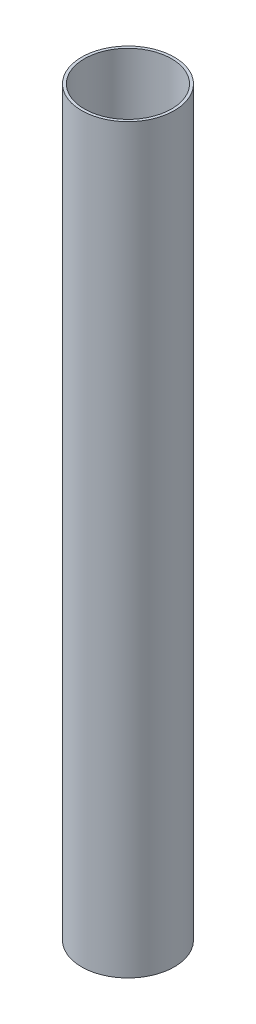
ISO-10303-21;
HEADER;
FILE_DESCRIPTION(('STEP AP214'),'2;1');
FILE_NAME('part.step','',(''),(''),'','','');
FILE_SCHEMA(('AUTOMOTIVE_DESIGN { 1 0 10303 214 1 1 1 1 }'));
ENDSEC;
DATA;
#1=APPLICATION_CONTEXT('core data for automotive mechanical design processes');
#2=APPLICATION_PROTOCOL_DEFINITION('international standard','automotive_design',2000,#1);
#3=PRODUCT_CONTEXT('',#1,'mechanical');
#4=PRODUCT('Part','Part','',(#3));
#5=PRODUCT_RELATED_PRODUCT_CATEGORY('part','',(#4));
#6=PRODUCT_DEFINITION_FORMATION('','',#4);
#7=PRODUCT_DEFINITION_CONTEXT('part definition',#1,'design');
#8=PRODUCT_DEFINITION('design','',#6,#7);
#9=PRODUCT_DEFINITION_SHAPE('','',#8);
#10=(LENGTH_UNIT() NAMED_UNIT(*) SI_UNIT(.MILLI.,.METRE.));
#11=(NAMED_UNIT(*) PLANE_ANGLE_UNIT() SI_UNIT($,.RADIAN.));
#12=(NAMED_UNIT(*) SI_UNIT($,.STERADIAN.) SOLID_ANGLE_UNIT());
#13=UNCERTAINTY_MEASURE_WITH_UNIT(LENGTH_MEASURE(1.E-05),#10,'distance_accuracy_value','');
#14=(GEOMETRIC_REPRESENTATION_CONTEXT(3) GLOBAL_UNCERTAINTY_ASSIGNED_CONTEXT((#13)) GLOBAL_UNIT_ASSIGNED_CONTEXT((#10,
#11,#12)) REPRESENTATION_CONTEXT('',''));
#15=CARTESIAN_POINT('',(0.,0.,0.));
#16=DIRECTION('',(0.,0.,1.));
#17=DIRECTION('',(1.,0.,0.));
#18=AXIS2_PLACEMENT_3D('',#15,#16,#17);
#19=CARTESIAN_POINT('',(0.,0.,0.));
#20=DIRECTION('',(0.,-1.,0.));
#21=DIRECTION('',(0.,0.,-1.));
#22=AXIS2_PLACEMENT_3D('',#19,#20,#21);
#23=CYLINDRICAL_SURFACE('',#22,6.35);
#24=CARTESIAN_POINT('',(0.,-101.6,0.));
#25=DIRECTION('',(0.,1.,0.));
#26=DIRECTION('',(0.,0.,1.));
#27=AXIS2_PLACEMENT_3D('',#24,#25,#26);
#28=CIRCLE('',#27,6.35);
#29=CARTESIAN_POINT('',(0.,-101.6,6.34999999999999));
#30=VERTEX_POINT('',#29);
#31=EDGE_CURVE('E44',#30,#30,#28,.T.);
#32=ORIENTED_EDGE('',*,*,#31,.T.);
#33=EDGE_LOOP('',(#32));
#34=FACE_BOUND('',#33,.T.);
#35=CARTESIAN_POINT('',(0.,0.,0.));
#36=DIRECTION('',(0.,1.,0.));
#37=DIRECTION('',(0.,0.,1.));
#38=AXIS2_PLACEMENT_3D('',#35,#36,#37);
#39=CIRCLE('',#38,6.35);
#40=CARTESIAN_POINT('',(0.,0.,6.35));
#41=VERTEX_POINT('',#40);
#42=EDGE_CURVE('E35',#41,#41,#39,.T.);
#43=ORIENTED_EDGE('',*,*,#42,.F.);
#44=EDGE_LOOP('',(#43));
#45=FACE_BOUND('',#44,.T.);
#46=ADVANCED_FACE('F32',(#34,#45),#23,.T.);
#47=CARTESIAN_POINT('',(0.,0.,0.));
#48=DIRECTION('',(0.,1.,0.));
#49=DIRECTION('',(0.,0.,1.));
#50=AXIS2_PLACEMENT_3D('',#47,#48,#49);
#51=PLANE('',#50);
#52=CARTESIAN_POINT('',(0.,0.,0.));
#53=DIRECTION('',(0.,1.,0.));
#54=DIRECTION('',(0.,0.,1.));
#55=AXIS2_PLACEMENT_3D('',#52,#53,#54);
#56=CIRCLE('',#55,5.969);
#57=CARTESIAN_POINT('',(0.,0.,5.969));
#58=VERTEX_POINT('',#57);
#59=EDGE_CURVE('E39',#58,#58,#56,.F.);
#60=ORIENTED_EDGE('',*,*,#59,.T.);
#61=EDGE_LOOP('',(#60));
#62=FACE_BOUND('',#61,.T.);
#63=ORIENTED_EDGE('',*,*,#42,.T.);
#64=EDGE_LOOP('',(#63));
#65=FACE_BOUND('',#64,.T.);
#66=ADVANCED_FACE('F52',(#62,#65),#51,.T.);
#67=CARTESIAN_POINT('',(0.,-101.6,0.));
#68=DIRECTION('',(0.,1.,0.));
#69=DIRECTION('',(0.,0.,1.));
#70=AXIS2_PLACEMENT_3D('',#67,#68,#69);
#71=PLANE('',#70);
#72=CARTESIAN_POINT('',(0.,-101.6,0.));
#73=DIRECTION('',(0.,1.,0.));
#74=DIRECTION('',(0.,0.,1.));
#75=AXIS2_PLACEMENT_3D('',#72,#73,#74);
#76=CIRCLE('',#75,5.969);
#77=CARTESIAN_POINT('',(0.,-101.6,5.96899999999999));
#78=VERTEX_POINT('',#77);
#79=EDGE_CURVE('E10',#78,#78,#76,.F.);
#80=ORIENTED_EDGE('',*,*,#79,.F.);
#81=EDGE_LOOP('',(#80));
#82=FACE_BOUND('',#81,.T.);
#83=ORIENTED_EDGE('',*,*,#31,.F.);
#84=EDGE_LOOP('',(#83));
#85=FACE_BOUND('',#84,.T.);
#86=ADVANCED_FACE('F58',(#82,#85),#71,.F.);
#87=CARTESIAN_POINT('',(0.,0.,0.));
#88=DIRECTION('',(0.,-1.,0.));
#89=DIRECTION('',(0.,0.,-1.));
#90=AXIS2_PLACEMENT_3D('',#87,#88,#89);
#91=CYLINDRICAL_SURFACE('',#90,5.969);
#92=ORIENTED_EDGE('',*,*,#79,.T.);
#93=EDGE_LOOP('',(#92));
#94=FACE_BOUND('',#93,.T.);
#95=ORIENTED_EDGE('',*,*,#59,.F.);
#96=EDGE_LOOP('',(#95));
#97=FACE_BOUND('',#96,.T.);
#98=ADVANCED_FACE('F60',(#94,#97),#91,.F.);
#99=CLOSED_SHELL('',(#46,#66,#86,#98));
#100=MANIFOLD_SOLID_BREP('B2',#99);
#101=ADVANCED_BREP_SHAPE_REPRESENTATION('',(#18,#100),#14);
#102=SHAPE_DEFINITION_REPRESENTATION(#9,#101);
ENDSEC;
END-ISO-10303-21;
